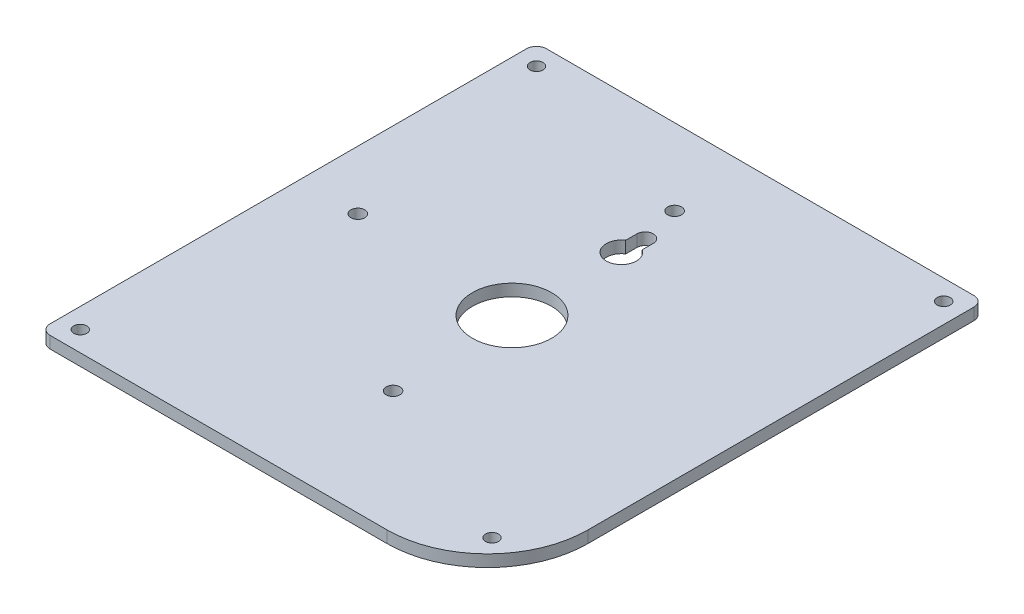
ISO-10303-21;
HEADER;
FILE_DESCRIPTION(('STEP AP214'),'2;1');
FILE_NAME('part.step','',(''),(''),'','','');
FILE_SCHEMA(('AUTOMOTIVE_DESIGN { 1 0 10303 214 1 1 1 1 }'));
ENDSEC;
DATA;
#1=APPLICATION_CONTEXT('core data for automotive mechanical design processes');
#2=APPLICATION_PROTOCOL_DEFINITION('international standard','automotive_design',2000,#1);
#3=PRODUCT_CONTEXT('',#1,'mechanical');
#4=PRODUCT('Part','Part','',(#3));
#5=PRODUCT_RELATED_PRODUCT_CATEGORY('part','',(#4));
#6=PRODUCT_DEFINITION_FORMATION('','',#4);
#7=PRODUCT_DEFINITION_CONTEXT('part definition',#1,'design');
#8=PRODUCT_DEFINITION('design','',#6,#7);
#9=PRODUCT_DEFINITION_SHAPE('','',#8);
#10=(LENGTH_UNIT() NAMED_UNIT(*) SI_UNIT(.MILLI.,.METRE.));
#11=(NAMED_UNIT(*) PLANE_ANGLE_UNIT() SI_UNIT($,.RADIAN.));
#12=(NAMED_UNIT(*) SI_UNIT($,.STERADIAN.) SOLID_ANGLE_UNIT());
#13=UNCERTAINTY_MEASURE_WITH_UNIT(LENGTH_MEASURE(1.E-05),#10,'distance_accuracy_value','');
#14=(GEOMETRIC_REPRESENTATION_CONTEXT(3) GLOBAL_UNCERTAINTY_ASSIGNED_CONTEXT((#13)) GLOBAL_UNIT_ASSIGNED_CONTEXT((#10,
#11,#12)) REPRESENTATION_CONTEXT('',''));
#15=CARTESIAN_POINT('',(0.,0.,0.));
#16=DIRECTION('',(0.,0.,1.));
#17=DIRECTION('',(1.,0.,0.));
#18=AXIS2_PLACEMENT_3D('',#15,#16,#17);
#19=CARTESIAN_POINT('',(22.8844907346791,3.,46.8900761871675));
#20=DIRECTION('',(0.,1.,0.));
#21=DIRECTION('',(0.,0.,1.));
#22=AXIS2_PLACEMENT_3D('',#19,#20,#21);
#23=PLANE('',#22);
#24=CARTESIAN_POINT('',(-8.22550927532092,3.,9.59004918716748));
#25=DIRECTION('',(0.,1.,0.));
#26=DIRECTION('',(0.,0.,1.));
#27=AXIS2_PLACEMENT_3D('',#24,#25,#26);
#28=CIRCLE('',#27,10.);
#29=CARTESIAN_POINT('',(-8.22550927532092,3.,19.5900491871675));
#30=VERTEX_POINT('',#29);
#31=EDGE_CURVE('E480',#30,#30,#28,.T.);
#32=ORIENTED_EDGE('',*,*,#31,.F.);
#33=EDGE_LOOP('',(#32));
#34=FACE_BOUND('',#33,.T.);
#35=CARTESIAN_POINT('',(-10.5655092853209,3.,-33.8199778128325));
#36=DIRECTION('',(0.,1.,0.));
#37=DIRECTION('',(0.,0.,1.));
#38=AXIS2_PLACEMENT_3D('',#35,#36,#37);
#39=CIRCLE('',#38,1.75);
#40=CARTESIAN_POINT('',(-10.5655092853209,3.,-32.0699778128325));
#41=VERTEX_POINT('',#40);
#42=EDGE_CURVE('E482',#41,#41,#39,.T.);
#43=ORIENTED_EDGE('',*,*,#42,.F.);
#44=EDGE_LOOP('',(#43));
#45=FACE_BOUND('',#44,.T.);
#46=CARTESIAN_POINT('',(-6.75550928532093,3.,41.1100221871675));
#47=DIRECTION('',(0.,1.,0.));
#48=DIRECTION('',(0.,0.,1.));
#49=AXIS2_PLACEMENT_3D('',#46,#47,#48);
#50=CIRCLE('',#49,1.75);
#51=CARTESIAN_POINT('',(-6.75550928532093,3.,42.8600221871675));
#52=VERTEX_POINT('',#51);
#53=EDGE_CURVE('E488',#52,#52,#50,.T.);
#54=ORIENTED_EDGE('',*,*,#53,.F.);
#55=EDGE_LOOP('',(#54));
#56=FACE_BOUND('',#55,.T.);
#57=CARTESIAN_POINT('',(-49.9355092853209,3.,6.82002218716749));
#58=DIRECTION('',(0.,1.,0.));
#59=DIRECTION('',(0.,0.,1.));
#60=AXIS2_PLACEMENT_3D('',#57,#58,#59);
#61=CIRCLE('',#60,1.75);
#62=CARTESIAN_POINT('',(-49.9355092853209,3.,8.5700221871675));
#63=VERTEX_POINT('',#62);
#64=EDGE_CURVE('E154',#63,#63,#61,.T.);
#65=ORIENTED_EDGE('',*,*,#64,.F.);
#66=EDGE_LOOP('',(#65));
#67=FACE_BOUND('',#66,.T.);
#68=CARTESIAN_POINT('',(-8.2255092753209,3.,-24.0299778128325));
#69=DIRECTION('',(0.,1.,0.));
#70=DIRECTION('',(0.,0.,1.));
#71=AXIS2_PLACEMENT_3D('',#68,#69,#70);
#72=CIRCLE('',#71,2.0828);
#73=CARTESIAN_POINT('',(-6.14270927532091,3.,-24.0299778128325));
#74=VERTEX_POINT('',#73);
#75=CARTESIAN_POINT('',(-10.3083092753209,3.,-24.0299778128325));
#76=VERTEX_POINT('',#75);
#77=EDGE_CURVE('E130',#74,#76,#72,.T.);
#78=ORIENTED_EDGE('',*,*,#77,.F.);
#79=DIRECTION('',(0.,0.,-1.));
#80=VECTOR('',#79,1.);
#81=CARTESIAN_POINT('',(-6.14270927532091,3.,-24.0299778128325));
#82=LINE('',#81,#80);
#83=CARTESIAN_POINT('',(-6.14270927532091,3.,-21.220282525552));
#84=VERTEX_POINT('',#83);
#85=EDGE_CURVE('E148',#84,#74,#82,.T.);
#86=ORIENTED_EDGE('',*,*,#85,.F.);
#87=CARTESIAN_POINT('',(-8.2255092753209,3.,-18.0299778128325));
#88=DIRECTION('',(0.,1.,0.));
#89=DIRECTION('',(0.,0.,1.));
#90=AXIS2_PLACEMENT_3D('',#87,#88,#89);
#91=CIRCLE('',#90,3.81);
#92=CARTESIAN_POINT('',(-10.3083092753209,3.,-21.220282525552));
#93=VERTEX_POINT('',#92);
#94=EDGE_CURVE('E151',#93,#84,#91,.T.);
#95=ORIENTED_EDGE('',*,*,#94,.F.);
#96=DIRECTION('',(0.,0.,1.));
#97=VECTOR('',#96,1.);
#98=CARTESIAN_POINT('',(-10.3083092753209,3.,-24.0299778128325));
#99=LINE('',#98,#97);
#100=EDGE_CURVE('E160',#76,#93,#99,.T.);
#101=ORIENTED_EDGE('',*,*,#100,.F.);
#102=EDGE_LOOP('',(#78,#86,#95,#101));
#103=FACE_BOUND('',#102,.T.);
#104=CARTESIAN_POINT('',(-59.6555092853209,3.,67.2100761871675));
#105=DIRECTION('',(0.,1.,0.));
#106=DIRECTION('',(0.,0.,1.));
#107=AXIS2_PLACEMENT_3D('',#104,#105,#106);
#108=CIRCLE('',#107,1.65);
#109=CARTESIAN_POINT('',(-59.6555092853209,3.,68.8600761871675));
#110=VERTEX_POINT('',#109);
#111=EDGE_CURVE('E177',#110,#110,#108,.T.);
#112=ORIENTED_EDGE('',*,*,#111,.F.);
#113=EDGE_LOOP('',(#112));
#114=FACE_BOUND('',#113,.T.);
#115=CARTESIAN_POINT('',(-59.6555092853209,3.,-48.0299778128325));
#116=DIRECTION('',(0.,1.,0.));
#117=DIRECTION('',(0.,0.,1.));
#118=AXIS2_PLACEMENT_3D('',#115,#116,#117);
#119=CIRCLE('',#118,1.65);
#120=CARTESIAN_POINT('',(-59.6555092853209,3.,-46.3799778128325));
#121=VERTEX_POINT('',#120);
#122=EDGE_CURVE('E189',#121,#121,#119,.T.);
#123=ORIENTED_EDGE('',*,*,#122,.F.);
#124=EDGE_LOOP('',(#123));
#125=FACE_BOUND('',#124,.T.);
#126=DIRECTION('',(0.,0.,-1.));
#127=VECTOR('',#126,1.);
#128=CARTESIAN_POINT('',(48.2844907346791,3.,-53.1099778128325));
#129=LINE('',#128,#127);
#130=CARTESIAN_POINT('',(48.2844907346791,3.,46.8900761871675));
#131=VERTEX_POINT('',#130);
#132=CARTESIAN_POINT('',(48.2844907346791,3.,-50.5699778128325));
#133=VERTEX_POINT('',#132);
#134=EDGE_CURVE('E195',#131,#133,#129,.T.);
#135=ORIENTED_EDGE('',*,*,#134,.T.);
#136=CARTESIAN_POINT('',(45.7444907346791,3.,-50.5699778128325));
#137=DIRECTION('',(0.,1.,0.));
#138=DIRECTION('',(0.,0.,1.));
#139=AXIS2_PLACEMENT_3D('',#136,#137,#138);
#140=CIRCLE('',#139,2.54);
#141=CARTESIAN_POINT('',(45.7444907346791,3.,-53.1099778128325));
#142=VERTEX_POINT('',#141);
#143=EDGE_CURVE('E240',#133,#142,#140,.T.);
#144=ORIENTED_EDGE('',*,*,#143,.T.);
#145=DIRECTION('',(-1.,0.,0.));
#146=VECTOR('',#145,1.);
#147=CARTESIAN_POINT('',(48.2844907346791,3.,-53.1099778128325));
#148=LINE('',#147,#146);
#149=CARTESIAN_POINT('',(-62.1955092853209,3.,-53.1099778128325));
#150=VERTEX_POINT('',#149);
#151=EDGE_CURVE('E198',#142,#150,#148,.T.);
#152=ORIENTED_EDGE('',*,*,#151,.T.);
#153=CARTESIAN_POINT('',(-62.1955092853209,3.,-50.5699778128325));
#154=DIRECTION('',(0.,1.,0.));
#155=DIRECTION('',(0.,0.,1.));
#156=AXIS2_PLACEMENT_3D('',#153,#154,#155);
#157=CIRCLE('',#156,2.54);
#158=CARTESIAN_POINT('',(-64.7355092853209,3.,-50.5699778128325));
#159=VERTEX_POINT('',#158);
#160=EDGE_CURVE('E238',#150,#159,#157,.T.);
#161=ORIENTED_EDGE('',*,*,#160,.T.);
#162=DIRECTION('',(0.,0.,1.));
#163=VECTOR('',#162,1.);
#164=CARTESIAN_POINT('',(-64.7355092853209,3.,-53.1099778128325));
#165=LINE('',#164,#163);
#166=CARTESIAN_POINT('',(-64.7355092853209,3.,69.7500761871675));
#167=VERTEX_POINT('',#166);
#168=EDGE_CURVE('E202',#159,#167,#165,.T.);
#169=ORIENTED_EDGE('',*,*,#168,.T.);
#170=CARTESIAN_POINT('',(-62.1955092853209,3.,69.7500761871675));
#171=DIRECTION('',(0.,1.,0.));
#172=DIRECTION('',(0.,0.,1.));
#173=AXIS2_PLACEMENT_3D('',#170,#171,#172);
#174=CIRCLE('',#173,2.54);
#175=CARTESIAN_POINT('',(-62.1955092853209,3.,72.2900761871675));
#176=VERTEX_POINT('',#175);
#177=EDGE_CURVE('E47',#167,#176,#174,.T.);
#178=ORIENTED_EDGE('',*,*,#177,.T.);
#179=DIRECTION('',(1.,0.,0.));
#180=VECTOR('',#179,1.);
#181=CARTESIAN_POINT('',(22.8844907346791,3.,72.2900761871675));
#182=LINE('',#181,#180);
#183=CARTESIAN_POINT('',(22.8844907346791,3.,72.2900761871675));
#184=VERTEX_POINT('',#183);
#185=EDGE_CURVE('E204',#176,#184,#182,.T.);
#186=ORIENTED_EDGE('',*,*,#185,.T.);
#187=CARTESIAN_POINT('',(22.8844907346791,3.,46.8900761871675));
#188=DIRECTION('',(0.,1.,0.));
#189=DIRECTION('',(0.,0.,1.));
#190=AXIS2_PLACEMENT_3D('',#187,#188,#189);
#191=CIRCLE('',#190,25.4);
#192=EDGE_CURVE('E206',#184,#131,#191,.T.);
#193=ORIENTED_EDGE('',*,*,#192,.T.);
#194=EDGE_LOOP('',(#135,#144,#152,#161,#169,#178,#186,#193));
#195=FACE_BOUND('',#194,.T.);
#196=CARTESIAN_POINT('',(43.2044907346791,3.,-48.0299778128325));
#197=DIRECTION('',(0.,1.,0.));
#198=DIRECTION('',(0.,0.,1.));
#199=AXIS2_PLACEMENT_3D('',#196,#197,#198);
#200=CIRCLE('',#199,1.65);
#201=CARTESIAN_POINT('',(43.2044907346791,3.,-46.3799778128325));
#202=VERTEX_POINT('',#201);
#203=EDGE_CURVE('E183',#202,#202,#200,.T.);
#204=ORIENTED_EDGE('',*,*,#203,.F.);
#205=EDGE_LOOP('',(#204));
#206=FACE_BOUND('',#205,.T.);
#207=CARTESIAN_POINT('',(37.8808925712128,3.,60.7484791239135));
#208=DIRECTION('',(0.,1.,0.));
#209=DIRECTION('',(0.,0.,1.));
#210=AXIS2_PLACEMENT_3D('',#207,#208,#209);
#211=CIRCLE('',#210,1.65);
#212=CARTESIAN_POINT('',(37.8808925712128,3.,62.3984791239135));
#213=VERTEX_POINT('',#212);
#214=EDGE_CURVE('E171',#213,#213,#211,.T.);
#215=ORIENTED_EDGE('',*,*,#214,.F.);
#216=EDGE_LOOP('',(#215));
#217=FACE_BOUND('',#216,.T.);
#218=ADVANCED_FACE('F32',(#34,#45,#56,#67,#103,#114,#125,#195,#206,#217),#23,.T.);
#219=CARTESIAN_POINT('',(22.8844907346791,0.,46.8900761871675));
#220=DIRECTION('',(0.,1.,0.));
#221=DIRECTION('',(0.,0.,1.));
#222=AXIS2_PLACEMENT_3D('',#219,#220,#221);
#223=PLANE('',#222);
#224=CARTESIAN_POINT('',(-8.22550927532092,0.,9.59004918716748));
#225=DIRECTION('',(0.,1.,0.));
#226=DIRECTION('',(0.,0.,1.));
#227=AXIS2_PLACEMENT_3D('',#224,#225,#226);
#228=CIRCLE('',#227,10.);
#229=CARTESIAN_POINT('',(-8.22550927532092,0.,19.5900491871675));
#230=VERTEX_POINT('',#229);
#231=EDGE_CURVE('E478',#230,#230,#228,.T.);
#232=ORIENTED_EDGE('',*,*,#231,.T.);
#233=EDGE_LOOP('',(#232));
#234=FACE_BOUND('',#233,.T.);
#235=CARTESIAN_POINT('',(-10.5655092853209,0.,-33.8199778128325));
#236=DIRECTION('',(0.,1.,0.));
#237=DIRECTION('',(0.,0.,1.));
#238=AXIS2_PLACEMENT_3D('',#235,#236,#237);
#239=CIRCLE('',#238,1.75);
#240=CARTESIAN_POINT('',(-10.5655092853209,0.,-32.0699778128325));
#241=VERTEX_POINT('',#240);
#242=EDGE_CURVE('E485',#241,#241,#239,.T.);
#243=ORIENTED_EDGE('',*,*,#242,.T.);
#244=EDGE_LOOP('',(#243));
#245=FACE_BOUND('',#244,.T.);
#246=CARTESIAN_POINT('',(-6.75550928532093,0.,41.1100221871675));
#247=DIRECTION('',(0.,1.,0.));
#248=DIRECTION('',(0.,0.,1.));
#249=AXIS2_PLACEMENT_3D('',#246,#247,#248);
#250=CIRCLE('',#249,1.75);
#251=CARTESIAN_POINT('',(-6.75550928532093,0.,42.8600221871675));
#252=VERTEX_POINT('',#251);
#253=EDGE_CURVE('E491',#252,#252,#250,.T.);
#254=ORIENTED_EDGE('',*,*,#253,.T.);
#255=EDGE_LOOP('',(#254));
#256=FACE_BOUND('',#255,.T.);
#257=CARTESIAN_POINT('',(-49.9355092853209,0.,6.82002218716749));
#258=DIRECTION('',(0.,1.,0.));
#259=DIRECTION('',(0.,0.,1.));
#260=AXIS2_PLACEMENT_3D('',#257,#258,#259);
#261=CIRCLE('',#260,1.75);
#262=CARTESIAN_POINT('',(-49.9355092853209,0.,8.5700221871675));
#263=VERTEX_POINT('',#262);
#264=EDGE_CURVE('E161',#263,#263,#261,.T.);
#265=ORIENTED_EDGE('',*,*,#264,.T.);
#266=EDGE_LOOP('',(#265));
#267=FACE_BOUND('',#266,.T.);
#268=DIRECTION('',(0.,0.,-1.));
#269=VECTOR('',#268,1.);
#270=CARTESIAN_POINT('',(-6.14270927532091,0.,-24.0299778128325));
#271=LINE('',#270,#269);
#272=CARTESIAN_POINT('',(-6.14270927532091,0.,-21.220282525552));
#273=VERTEX_POINT('',#272);
#274=CARTESIAN_POINT('',(-6.14270927532091,0.,-24.0299778128325));
#275=VERTEX_POINT('',#274);
#276=EDGE_CURVE('E135',#273,#275,#271,.T.);
#277=ORIENTED_EDGE('',*,*,#276,.T.);
#278=CARTESIAN_POINT('',(-8.2255092753209,0.,-24.0299778128325));
#279=DIRECTION('',(0.,1.,0.));
#280=DIRECTION('',(0.,0.,1.));
#281=AXIS2_PLACEMENT_3D('',#278,#279,#280);
#282=CIRCLE('',#281,2.0828);
#283=CARTESIAN_POINT('',(-10.3083092753209,0.,-24.0299778128325));
#284=VERTEX_POINT('',#283);
#285=EDGE_CURVE('E127',#275,#284,#282,.T.);
#286=ORIENTED_EDGE('',*,*,#285,.T.);
#287=DIRECTION('',(0.,0.,1.));
#288=VECTOR('',#287,1.);
#289=CARTESIAN_POINT('',(-10.3083092753209,0.,-24.0299778128325));
#290=LINE('',#289,#288);
#291=CARTESIAN_POINT('',(-10.3083092753209,0.,-21.220282525552));
#292=VERTEX_POINT('',#291);
#293=EDGE_CURVE('E139',#284,#292,#290,.T.);
#294=ORIENTED_EDGE('',*,*,#293,.T.);
#295=CARTESIAN_POINT('',(-8.2255092753209,0.,-18.0299778128325));
#296=DIRECTION('',(0.,1.,0.));
#297=DIRECTION('',(0.,0.,1.));
#298=AXIS2_PLACEMENT_3D('',#295,#296,#297);
#299=CIRCLE('',#298,3.81);
#300=EDGE_CURVE('E143',#292,#273,#299,.T.);
#301=ORIENTED_EDGE('',*,*,#300,.T.);
#302=EDGE_LOOP('',(#277,#286,#294,#301));
#303=FACE_BOUND('',#302,.T.);
#304=CARTESIAN_POINT('',(-59.6555092853209,0.,67.2100761871675));
#305=DIRECTION('',(0.,1.,0.));
#306=DIRECTION('',(0.,0.,1.));
#307=AXIS2_PLACEMENT_3D('',#304,#305,#306);
#308=CIRCLE('',#307,1.65);
#309=CARTESIAN_POINT('',(-59.6555092853209,0.,68.8600761871675));
#310=VERTEX_POINT('',#309);
#311=EDGE_CURVE('E174',#310,#310,#308,.T.);
#312=ORIENTED_EDGE('',*,*,#311,.T.);
#313=EDGE_LOOP('',(#312));
#314=FACE_BOUND('',#313,.T.);
#315=CARTESIAN_POINT('',(-59.6555092853209,0.,-48.0299778128325));
#316=DIRECTION('',(0.,1.,0.));
#317=DIRECTION('',(0.,0.,1.));
#318=AXIS2_PLACEMENT_3D('',#315,#316,#317);
#319=CIRCLE('',#318,1.65);
#320=CARTESIAN_POINT('',(-59.6555092853209,0.,-46.3799778128325));
#321=VERTEX_POINT('',#320);
#322=EDGE_CURVE('E186',#321,#321,#319,.T.);
#323=ORIENTED_EDGE('',*,*,#322,.T.);
#324=EDGE_LOOP('',(#323));
#325=FACE_BOUND('',#324,.T.);
#326=DIRECTION('',(-1.,0.,0.));
#327=VECTOR('',#326,1.);
#328=CARTESIAN_POINT('',(48.2844907346791,0.,-53.1099778128325));
#329=LINE('',#328,#327);
#330=CARTESIAN_POINT('',(45.7444907346791,0.,-53.1099778128325));
#331=VERTEX_POINT('',#330);
#332=CARTESIAN_POINT('',(-62.1955092853209,0.,-53.1099778128325));
#333=VERTEX_POINT('',#332);
#334=EDGE_CURVE('E211',#331,#333,#329,.T.);
#335=ORIENTED_EDGE('',*,*,#334,.F.);
#336=CARTESIAN_POINT('',(45.7444907346791,0.,-50.5699778128325));
#337=DIRECTION('',(0.,1.,0.));
#338=DIRECTION('',(0.,0.,1.));
#339=AXIS2_PLACEMENT_3D('',#336,#337,#338);
#340=CIRCLE('',#339,2.54);
#341=CARTESIAN_POINT('',(48.2844907346791,0.,-50.5699778128325));
#342=VERTEX_POINT('',#341);
#343=EDGE_CURVE('E233',#331,#342,#340,.F.);
#344=ORIENTED_EDGE('',*,*,#343,.T.);
#345=DIRECTION('',(0.,0.,-1.));
#346=VECTOR('',#345,1.);
#347=CARTESIAN_POINT('',(48.2844907346791,0.,-53.1099778128325));
#348=LINE('',#347,#346);
#349=CARTESIAN_POINT('',(48.2844907346791,0.,46.8900761871675));
#350=VERTEX_POINT('',#349);
#351=EDGE_CURVE('E192',#350,#342,#348,.T.);
#352=ORIENTED_EDGE('',*,*,#351,.F.);
#353=CARTESIAN_POINT('',(22.8844907346791,0.,46.8900761871675));
#354=DIRECTION('',(0.,1.,0.));
#355=DIRECTION('',(0.,0.,1.));
#356=AXIS2_PLACEMENT_3D('',#353,#354,#355);
#357=CIRCLE('',#356,25.4);
#358=CARTESIAN_POINT('',(22.8844907346791,0.,72.2900761871675));
#359=VERTEX_POINT('',#358);
#360=EDGE_CURVE('E199',#359,#350,#357,.T.);
#361=ORIENTED_EDGE('',*,*,#360,.F.);
#362=DIRECTION('',(1.,0.,0.));
#363=VECTOR('',#362,1.);
#364=CARTESIAN_POINT('',(22.8844907346791,0.,72.2900761871675));
#365=LINE('',#364,#363);
#366=CARTESIAN_POINT('',(-62.1955092853209,0.,72.2900761871675));
#367=VERTEX_POINT('',#366);
#368=EDGE_CURVE('E216',#367,#359,#365,.T.);
#369=ORIENTED_EDGE('',*,*,#368,.F.);
#370=CARTESIAN_POINT('',(-62.1955092853209,0.,69.7500761871675));
#371=DIRECTION('',(0.,1.,0.));
#372=DIRECTION('',(0.,0.,1.));
#373=AXIS2_PLACEMENT_3D('',#370,#371,#372);
#374=CIRCLE('',#373,2.54);
#375=CARTESIAN_POINT('',(-64.7355092853209,0.,69.7500761871675));
#376=VERTEX_POINT('',#375);
#377=EDGE_CURVE('E229',#367,#376,#374,.F.);
#378=ORIENTED_EDGE('',*,*,#377,.T.);
#379=DIRECTION('',(0.,0.,1.));
#380=VECTOR('',#379,1.);
#381=CARTESIAN_POINT('',(-64.7355092853209,0.,-53.1099778128325));
#382=LINE('',#381,#380);
#383=CARTESIAN_POINT('',(-64.7355092853209,0.,-50.5699778128325));
#384=VERTEX_POINT('',#383);
#385=EDGE_CURVE('E214',#384,#376,#382,.T.);
#386=ORIENTED_EDGE('',*,*,#385,.F.);
#387=CARTESIAN_POINT('',(-62.1955092853209,0.,-50.5699778128325));
#388=DIRECTION('',(0.,1.,0.));
#389=DIRECTION('',(0.,0.,1.));
#390=AXIS2_PLACEMENT_3D('',#387,#388,#389);
#391=CIRCLE('',#390,2.54);
#392=EDGE_CURVE('E231',#384,#333,#391,.F.);
#393=ORIENTED_EDGE('',*,*,#392,.T.);
#394=EDGE_LOOP('',(#335,#344,#352,#361,#369,#378,#386,#393));
#395=FACE_BOUND('',#394,.T.);
#396=CARTESIAN_POINT('',(43.2044907346791,0.,-48.0299778128325));
#397=DIRECTION('',(0.,1.,0.));
#398=DIRECTION('',(0.,0.,1.));
#399=AXIS2_PLACEMENT_3D('',#396,#397,#398);
#400=CIRCLE('',#399,1.65);
#401=CARTESIAN_POINT('',(43.2044907346791,0.,-46.3799778128325));
#402=VERTEX_POINT('',#401);
#403=EDGE_CURVE('E180',#402,#402,#400,.T.);
#404=ORIENTED_EDGE('',*,*,#403,.T.);
#405=EDGE_LOOP('',(#404));
#406=FACE_BOUND('',#405,.T.);
#407=CARTESIAN_POINT('',(37.8808925712128,0.,60.7484791239135));
#408=DIRECTION('',(0.,1.,0.));
#409=DIRECTION('',(0.,0.,1.));
#410=AXIS2_PLACEMENT_3D('',#407,#408,#409);
#411=CIRCLE('',#410,1.65);
#412=CARTESIAN_POINT('',(37.8808925712128,0.,62.3984791239135));
#413=VERTEX_POINT('',#412);
#414=EDGE_CURVE('E167',#413,#413,#411,.T.);
#415=ORIENTED_EDGE('',*,*,#414,.T.);
#416=EDGE_LOOP('',(#415));
#417=FACE_BOUND('',#416,.T.);
#418=ADVANCED_FACE('F145',(#234,#245,#256,#267,#303,#314,#325,#395,#406,#417),#223,.F.);
#419=CARTESIAN_POINT('',(48.2844907346791,3.,-53.1099778128325));
#420=DIRECTION('',(-1.,0.,0.));
#421=DIRECTION('',(0.,0.,1.));
#422=AXIS2_PLACEMENT_3D('',#419,#420,#421);
#423=PLANE('',#422);
#424=ORIENTED_EDGE('',*,*,#351,.T.);
#425=DIRECTION('',(0.,-1.,0.));
#426=VECTOR('',#425,1.);
#427=CARTESIAN_POINT('',(48.2844907346791,3.,-50.5699778128325));
#428=LINE('',#427,#426);
#429=EDGE_CURVE('E235',#342,#133,#428,.F.);
#430=ORIENTED_EDGE('',*,*,#429,.T.);
#431=ORIENTED_EDGE('',*,*,#134,.F.);
#432=DIRECTION('',(0.,-1.,0.));
#433=VECTOR('',#432,1.);
#434=CARTESIAN_POINT('',(48.2844907346791,3.,46.8900761871675));
#435=LINE('',#434,#433);
#436=EDGE_CURVE('E208',#131,#350,#435,.T.);
#437=ORIENTED_EDGE('',*,*,#436,.T.);
#438=EDGE_LOOP('',(#424,#430,#431,#437));
#439=FACE_BOUND('',#438,.T.);
#440=ADVANCED_FACE('F267',(#439),#423,.F.);
#441=CARTESIAN_POINT('',(48.2844907346791,3.,-53.1099778128325));
#442=DIRECTION('',(0.,0.,1.));
#443=DIRECTION('',(1.,0.,0.));
#444=AXIS2_PLACEMENT_3D('',#441,#442,#443);
#445=PLANE('',#444);
#446=ORIENTED_EDGE('',*,*,#151,.F.);
#447=DIRECTION('',(0.,-1.,0.));
#448=VECTOR('',#447,1.);
#449=CARTESIAN_POINT('',(45.7444907346791,3.,-53.1099778128325));
#450=LINE('',#449,#448);
#451=EDGE_CURVE('E226',#142,#331,#450,.T.);
#452=ORIENTED_EDGE('',*,*,#451,.T.);
#453=ORIENTED_EDGE('',*,*,#334,.T.);
#454=DIRECTION('',(0.,-1.,0.));
#455=VECTOR('',#454,1.);
#456=CARTESIAN_POINT('',(-62.1955092853209,3.,-53.1099778128325));
#457=LINE('',#456,#455);
#458=EDGE_CURVE('E224',#333,#150,#457,.F.);
#459=ORIENTED_EDGE('',*,*,#458,.T.);
#460=EDGE_LOOP('',(#446,#452,#453,#459));
#461=FACE_BOUND('',#460,.T.);
#462=ADVANCED_FACE('F274',(#461),#445,.F.);
#463=CARTESIAN_POINT('',(-64.7355092853209,3.,-53.1099778128325));
#464=DIRECTION('',(1.,0.,0.));
#465=DIRECTION('',(0.,0.,-1.));
#466=AXIS2_PLACEMENT_3D('',#463,#464,#465);
#467=PLANE('',#466);
#468=ORIENTED_EDGE('',*,*,#168,.F.);
#469=DIRECTION('',(0.,-1.,0.));
#470=VECTOR('',#469,1.);
#471=CARTESIAN_POINT('',(-64.7355092853209,3.,-50.5699778128325));
#472=LINE('',#471,#470);
#473=EDGE_CURVE('E40',#159,#384,#472,.T.);
#474=ORIENTED_EDGE('',*,*,#473,.T.);
#475=ORIENTED_EDGE('',*,*,#385,.T.);
#476=DIRECTION('',(0.,-1.,0.));
#477=VECTOR('',#476,1.);
#478=CARTESIAN_POINT('',(-64.7355092853209,3.,69.7500761871675));
#479=LINE('',#478,#477);
#480=EDGE_CURVE('E55',#376,#167,#479,.F.);
#481=ORIENTED_EDGE('',*,*,#480,.T.);
#482=EDGE_LOOP('',(#468,#474,#475,#481));
#483=FACE_BOUND('',#482,.T.);
#484=ADVANCED_FACE('F245',(#483),#467,.F.);
#485=CARTESIAN_POINT('',(22.8844907346791,3.,72.2900761871675));
#486=DIRECTION('',(0.,0.,-1.));
#487=DIRECTION('',(-1.,0.,0.));
#488=AXIS2_PLACEMENT_3D('',#485,#486,#487);
#489=PLANE('',#488);
#490=ORIENTED_EDGE('',*,*,#185,.F.);
#491=DIRECTION('',(0.,-1.,0.));
#492=VECTOR('',#491,1.);
#493=CARTESIAN_POINT('',(-62.1955092853209,3.,72.2900761871675));
#494=LINE('',#493,#492);
#495=EDGE_CURVE('E11',#176,#367,#494,.T.);
#496=ORIENTED_EDGE('',*,*,#495,.T.);
#497=ORIENTED_EDGE('',*,*,#368,.T.);
#498=DIRECTION('',(0.,-1.,0.));
#499=VECTOR('',#498,1.);
#500=CARTESIAN_POINT('',(22.8844907346791,3.,72.2900761871675));
#501=LINE('',#500,#499);
#502=EDGE_CURVE('E221',#184,#359,#501,.T.);
#503=ORIENTED_EDGE('',*,*,#502,.F.);
#504=EDGE_LOOP('',(#490,#496,#497,#503));
#505=FACE_BOUND('',#504,.T.);
#506=ADVANCED_FACE('F256',(#505),#489,.F.);
#507=CARTESIAN_POINT('',(22.8844907346791,3.,46.8900761871675));
#508=DIRECTION('',(0.,-1.,0.));
#509=DIRECTION('',(0.,0.,-1.));
#510=AXIS2_PLACEMENT_3D('',#507,#508,#509);
#511=CYLINDRICAL_SURFACE('',#510,25.4);
#512=ORIENTED_EDGE('',*,*,#360,.T.);
#513=ORIENTED_EDGE('',*,*,#436,.F.);
#514=ORIENTED_EDGE('',*,*,#192,.F.);
#515=ORIENTED_EDGE('',*,*,#502,.T.);
#516=EDGE_LOOP('',(#512,#513,#514,#515));
#517=FACE_BOUND('',#516,.T.);
#518=ADVANCED_FACE('F264',(#517),#511,.T.);
#519=CARTESIAN_POINT('',(-59.6555092853209,3.,-48.0299778128325));
#520=DIRECTION('',(0.,-1.,0.));
#521=DIRECTION('',(0.,0.,-1.));
#522=AXIS2_PLACEMENT_3D('',#519,#520,#521);
#523=CYLINDRICAL_SURFACE('',#522,1.65);
#524=ORIENTED_EDGE('',*,*,#122,.T.);
#525=EDGE_LOOP('',(#524));
#526=FACE_BOUND('',#525,.T.);
#527=ORIENTED_EDGE('',*,*,#322,.F.);
#528=EDGE_LOOP('',(#527));
#529=FACE_BOUND('',#528,.T.);
#530=ADVANCED_FACE('F295',(#526,#529),#523,.F.);
#531=CARTESIAN_POINT('',(43.2044907346791,3.,-48.0299778128325));
#532=DIRECTION('',(0.,-1.,0.));
#533=DIRECTION('',(0.,0.,-1.));
#534=AXIS2_PLACEMENT_3D('',#531,#532,#533);
#535=CYLINDRICAL_SURFACE('',#534,1.65);
#536=ORIENTED_EDGE('',*,*,#203,.T.);
#537=EDGE_LOOP('',(#536));
#538=FACE_BOUND('',#537,.T.);
#539=ORIENTED_EDGE('',*,*,#403,.F.);
#540=EDGE_LOOP('',(#539));
#541=FACE_BOUND('',#540,.T.);
#542=ADVANCED_FACE('F334',(#538,#541),#535,.F.);
#543=CARTESIAN_POINT('',(-59.6555092853209,3.,67.2100761871675));
#544=DIRECTION('',(0.,-1.,0.));
#545=DIRECTION('',(0.,0.,-1.));
#546=AXIS2_PLACEMENT_3D('',#543,#544,#545);
#547=CYLINDRICAL_SURFACE('',#546,1.65);
#548=ORIENTED_EDGE('',*,*,#111,.T.);
#549=EDGE_LOOP('',(#548));
#550=FACE_BOUND('',#549,.T.);
#551=ORIENTED_EDGE('',*,*,#311,.F.);
#552=EDGE_LOOP('',(#551));
#553=FACE_BOUND('',#552,.T.);
#554=ADVANCED_FACE('F341',(#550,#553),#547,.F.);
#555=CARTESIAN_POINT('',(37.8808925712128,3.,60.7484791239135));
#556=DIRECTION('',(0.,-1.,0.));
#557=DIRECTION('',(0.,0.,-1.));
#558=AXIS2_PLACEMENT_3D('',#555,#556,#557);
#559=CYLINDRICAL_SURFACE('',#558,1.65);
#560=ORIENTED_EDGE('',*,*,#214,.T.);
#561=EDGE_LOOP('',(#560));
#562=FACE_BOUND('',#561,.T.);
#563=ORIENTED_EDGE('',*,*,#414,.F.);
#564=EDGE_LOOP('',(#563));
#565=FACE_BOUND('',#564,.T.);
#566=ADVANCED_FACE('F348',(#562,#565),#559,.F.);
#567=CARTESIAN_POINT('',(-8.2255092753209,0.,-24.0299778128325));
#568=DIRECTION('',(0.,1.,0.));
#569=DIRECTION('',(0.,0.,1.));
#570=AXIS2_PLACEMENT_3D('',#567,#568,#569);
#571=CYLINDRICAL_SURFACE('',#570,2.0828);
#572=ORIENTED_EDGE('',*,*,#77,.T.);
#573=DIRECTION('',(0.,1.,0.));
#574=VECTOR('',#573,1.);
#575=CARTESIAN_POINT('',(-10.3083092753209,0.,-24.0299778128325));
#576=LINE('',#575,#574);
#577=EDGE_CURVE('E123',#284,#76,#576,.T.);
#578=ORIENTED_EDGE('',*,*,#577,.F.);
#579=ORIENTED_EDGE('',*,*,#285,.F.);
#580=DIRECTION('',(0.,1.,0.));
#581=VECTOR('',#580,1.);
#582=CARTESIAN_POINT('',(-6.14270927532091,0.,-24.0299778128325));
#583=LINE('',#582,#581);
#584=EDGE_CURVE('E165',#275,#74,#583,.T.);
#585=ORIENTED_EDGE('',*,*,#584,.T.);
#586=EDGE_LOOP('',(#572,#578,#579,#585));
#587=FACE_BOUND('',#586,.T.);
#588=ADVANCED_FACE('F125',(#587),#571,.F.);
#589=CARTESIAN_POINT('',(-6.14270927532091,0.,-24.0299778128325));
#590=DIRECTION('',(1.,0.,0.));
#591=DIRECTION('',(0.,0.,-1.));
#592=AXIS2_PLACEMENT_3D('',#589,#590,#591);
#593=PLANE('',#592);
#594=ORIENTED_EDGE('',*,*,#85,.T.);
#595=ORIENTED_EDGE('',*,*,#584,.F.);
#596=ORIENTED_EDGE('',*,*,#276,.F.);
#597=DIRECTION('',(0.,1.,0.));
#598=VECTOR('',#597,1.);
#599=CARTESIAN_POINT('',(-6.14270927532091,0.,-21.220282525552));
#600=LINE('',#599,#598);
#601=EDGE_CURVE('E168',#273,#84,#600,.T.);
#602=ORIENTED_EDGE('',*,*,#601,.T.);
#603=EDGE_LOOP('',(#594,#595,#596,#602));
#604=FACE_BOUND('',#603,.T.);
#605=ADVANCED_FACE('F363',(#604),#593,.F.);
#606=CARTESIAN_POINT('',(-8.2255092753209,0.,-18.0299778128325));
#607=DIRECTION('',(0.,1.,0.));
#608=DIRECTION('',(0.,0.,1.));
#609=AXIS2_PLACEMENT_3D('',#606,#607,#608);
#610=CYLINDRICAL_SURFACE('',#609,3.81);
#611=ORIENTED_EDGE('',*,*,#94,.T.);
#612=ORIENTED_EDGE('',*,*,#601,.F.);
#613=ORIENTED_EDGE('',*,*,#300,.F.);
#614=DIRECTION('',(0.,1.,0.));
#615=VECTOR('',#614,1.);
#616=CARTESIAN_POINT('',(-10.3083092753209,0.,-21.220282525552));
#617=LINE('',#616,#615);
#618=EDGE_CURVE('E134',#292,#93,#617,.T.);
#619=ORIENTED_EDGE('',*,*,#618,.T.);
#620=EDGE_LOOP('',(#611,#612,#613,#619));
#621=FACE_BOUND('',#620,.T.);
#622=ADVANCED_FACE('F370',(#621),#610,.F.);
#623=CARTESIAN_POINT('',(-10.3083092753209,0.,-24.0299778128325));
#624=DIRECTION('',(-1.,0.,0.));
#625=DIRECTION('',(0.,0.,1.));
#626=AXIS2_PLACEMENT_3D('',#623,#624,#625);
#627=PLANE('',#626);
#628=ORIENTED_EDGE('',*,*,#100,.T.);
#629=ORIENTED_EDGE('',*,*,#618,.F.);
#630=ORIENTED_EDGE('',*,*,#293,.F.);
#631=ORIENTED_EDGE('',*,*,#577,.T.);
#632=EDGE_LOOP('',(#628,#629,#630,#631));
#633=FACE_BOUND('',#632,.T.);
#634=ADVANCED_FACE('F140',(#633),#627,.F.);
#635=CARTESIAN_POINT('',(-49.9355092853209,0.,6.82002218716749));
#636=DIRECTION('',(0.,1.,0.));
#637=DIRECTION('',(0.,0.,1.));
#638=AXIS2_PLACEMENT_3D('',#635,#636,#637);
#639=CYLINDRICAL_SURFACE('',#638,1.75);
#640=ORIENTED_EDGE('',*,*,#264,.F.);
#641=EDGE_LOOP('',(#640));
#642=FACE_BOUND('',#641,.T.);
#643=ORIENTED_EDGE('',*,*,#64,.T.);
#644=EDGE_LOOP('',(#643));
#645=FACE_BOUND('',#644,.T.);
#646=ADVANCED_FACE('F385',(#642,#645),#639,.F.);
#647=CARTESIAN_POINT('',(-6.75550928532093,0.,41.1100221871675));
#648=DIRECTION('',(0.,1.,0.));
#649=DIRECTION('',(0.,0.,1.));
#650=AXIS2_PLACEMENT_3D('',#647,#648,#649);
#651=CYLINDRICAL_SURFACE('',#650,1.75);
#652=ORIENTED_EDGE('',*,*,#253,.F.);
#653=EDGE_LOOP('',(#652));
#654=FACE_BOUND('',#653,.T.);
#655=ORIENTED_EDGE('',*,*,#53,.T.);
#656=EDGE_LOOP('',(#655));
#657=FACE_BOUND('',#656,.T.);
#658=ADVANCED_FACE('F392',(#654,#657),#651,.F.);
#659=CARTESIAN_POINT('',(-10.5655092853209,0.,-33.8199778128325));
#660=DIRECTION('',(0.,1.,0.));
#661=DIRECTION('',(0.,0.,1.));
#662=AXIS2_PLACEMENT_3D('',#659,#660,#661);
#663=CYLINDRICAL_SURFACE('',#662,1.75);
#664=ORIENTED_EDGE('',*,*,#242,.F.);
#665=EDGE_LOOP('',(#664));
#666=FACE_BOUND('',#665,.T.);
#667=ORIENTED_EDGE('',*,*,#42,.T.);
#668=EDGE_LOOP('',(#667));
#669=FACE_BOUND('',#668,.T.);
#670=ADVANCED_FACE('F400',(#666,#669),#663,.F.);
#671=CARTESIAN_POINT('',(-8.22550927532092,0.,9.59004918716748));
#672=DIRECTION('',(0.,1.,0.));
#673=DIRECTION('',(0.,0.,1.));
#674=AXIS2_PLACEMENT_3D('',#671,#672,#673);
#675=CYLINDRICAL_SURFACE('',#674,10.);
#676=ORIENTED_EDGE('',*,*,#231,.F.);
#677=EDGE_LOOP('',(#676));
#678=FACE_BOUND('',#677,.T.);
#679=ORIENTED_EDGE('',*,*,#31,.T.);
#680=EDGE_LOOP('',(#679));
#681=FACE_BOUND('',#680,.T.);
#682=ADVANCED_FACE('F282',(#678,#681),#675,.F.);
#683=CARTESIAN_POINT('',(45.7444907346791,3.,-50.5699778128325));
#684=DIRECTION('',(0.,-1.,0.));
#685=DIRECTION('',(0.,0.,-1.));
#686=AXIS2_PLACEMENT_3D('',#683,#684,#685);
#687=CYLINDRICAL_SURFACE('',#686,2.54);
#688=ORIENTED_EDGE('',*,*,#143,.F.);
#689=ORIENTED_EDGE('',*,*,#429,.F.);
#690=ORIENTED_EDGE('',*,*,#343,.F.);
#691=ORIENTED_EDGE('',*,*,#451,.F.);
#692=EDGE_LOOP('',(#688,#689,#690,#691));
#693=FACE_BOUND('',#692,.T.);
#694=ADVANCED_FACE('F270',(#693),#687,.T.);
#695=CARTESIAN_POINT('',(-62.1955092853209,3.,-50.5699778128325));
#696=DIRECTION('',(0.,-1.,0.));
#697=DIRECTION('',(0.,0.,-1.));
#698=AXIS2_PLACEMENT_3D('',#695,#696,#697);
#699=CYLINDRICAL_SURFACE('',#698,2.54);
#700=ORIENTED_EDGE('',*,*,#160,.F.);
#701=ORIENTED_EDGE('',*,*,#458,.F.);
#702=ORIENTED_EDGE('',*,*,#392,.F.);
#703=ORIENTED_EDGE('',*,*,#473,.F.);
#704=EDGE_LOOP('',(#700,#701,#702,#703));
#705=FACE_BOUND('',#704,.T.);
#706=ADVANCED_FACE('F276',(#705),#699,.T.);
#707=CARTESIAN_POINT('',(-62.1955092853209,3.,69.7500761871675));
#708=DIRECTION('',(0.,-1.,0.));
#709=DIRECTION('',(0.,0.,-1.));
#710=AXIS2_PLACEMENT_3D('',#707,#708,#709);
#711=CYLINDRICAL_SURFACE('',#710,2.54);
#712=ORIENTED_EDGE('',*,*,#177,.F.);
#713=ORIENTED_EDGE('',*,*,#480,.F.);
#714=ORIENTED_EDGE('',*,*,#377,.F.);
#715=ORIENTED_EDGE('',*,*,#495,.F.);
#716=EDGE_LOOP('',(#712,#713,#714,#715));
#717=FACE_BOUND('',#716,.T.);
#718=ADVANCED_FACE('F34',(#717),#711,.T.);
#719=CLOSED_SHELL('',(#218,#418,#440,#462,#484,#506,#518,#530,#542,#554,#566,#588,#605,#622,
#634,#646,#658,#670,#682,#694,#706,#718));
#720=MANIFOLD_SOLID_BREP('B2',#719);
#721=ADVANCED_BREP_SHAPE_REPRESENTATION('',(#18,#720),#14);
#722=SHAPE_DEFINITION_REPRESENTATION(#9,#721);
ENDSEC;
END-ISO-10303-21;
